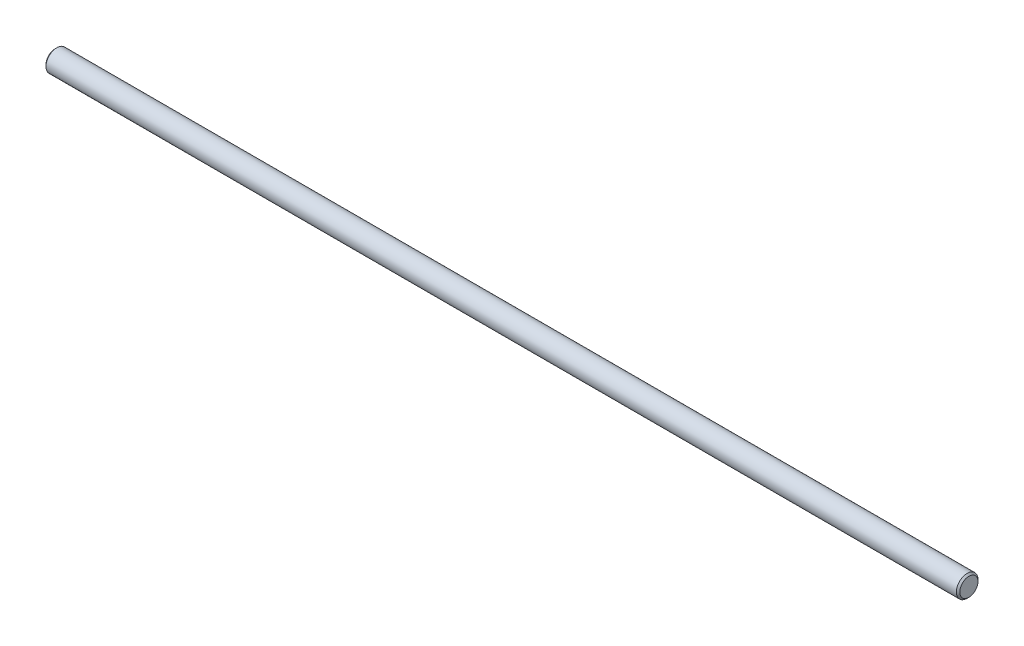
ISO-10303-21;
HEADER;
FILE_DESCRIPTION(('STEP AP214'),'2;1');
FILE_NAME('part.step','',(''),(''),'','','');
FILE_SCHEMA(('AUTOMOTIVE_DESIGN { 1 0 10303 214 1 1 1 1 }'));
ENDSEC;
DATA;
#1=APPLICATION_CONTEXT('core data for automotive mechanical design processes');
#2=APPLICATION_PROTOCOL_DEFINITION('international standard','automotive_design',2000,#1);
#3=PRODUCT_CONTEXT('',#1,'mechanical');
#4=PRODUCT('Part','Part','',(#3));
#5=PRODUCT_RELATED_PRODUCT_CATEGORY('part','',(#4));
#6=PRODUCT_DEFINITION_FORMATION('','',#4);
#7=PRODUCT_DEFINITION_CONTEXT('part definition',#1,'design');
#8=PRODUCT_DEFINITION('design','',#6,#7);
#9=PRODUCT_DEFINITION_SHAPE('','',#8);
#10=(LENGTH_UNIT() NAMED_UNIT(*) SI_UNIT(.MILLI.,.METRE.));
#11=(NAMED_UNIT(*) PLANE_ANGLE_UNIT() SI_UNIT($,.RADIAN.));
#12=(NAMED_UNIT(*) SI_UNIT($,.STERADIAN.) SOLID_ANGLE_UNIT());
#13=UNCERTAINTY_MEASURE_WITH_UNIT(LENGTH_MEASURE(1.E-05),#10,'distance_accuracy_value','');
#14=(GEOMETRIC_REPRESENTATION_CONTEXT(3) GLOBAL_UNCERTAINTY_ASSIGNED_CONTEXT((#13)) GLOBAL_UNIT_ASSIGNED_CONTEXT((#10,
#11,#12)) REPRESENTATION_CONTEXT('',''));
#15=CARTESIAN_POINT('',(0.,0.,0.));
#16=DIRECTION('',(0.,0.,1.));
#17=DIRECTION('',(1.,0.,0.));
#18=AXIS2_PLACEMENT_3D('',#15,#16,#17);
#19=CARTESIAN_POINT('',(268.,0.,0.));
#20=DIRECTION('',(-1.,0.,0.));
#21=DIRECTION('',(0.,0.,1.));
#22=AXIS2_PLACEMENT_3D('',#19,#20,#21);
#23=CYLINDRICAL_SURFACE('',#22,6.35);
#24=CARTESIAN_POINT('',(267.,0.,0.));
#25=DIRECTION('',(1.,0.,0.));
#26=DIRECTION('',(0.,0.,-1.));
#27=AXIS2_PLACEMENT_3D('',#24,#25,#26);
#28=CIRCLE('',#27,6.35);
#29=CARTESIAN_POINT('',(267.,0.,-6.35));
#30=VERTEX_POINT('',#29);
#31=EDGE_CURVE('E10',#30,#30,#28,.F.);
#32=ORIENTED_EDGE('',*,*,#31,.T.);
#33=EDGE_LOOP('',(#32));
#34=FACE_BOUND('',#33,.T.);
#35=CARTESIAN_POINT('',(-267.,0.,0.));
#36=DIRECTION('',(1.,0.,0.));
#37=DIRECTION('',(0.,0.,-1.));
#38=AXIS2_PLACEMENT_3D('',#35,#36,#37);
#39=CIRCLE('',#38,6.35);
#40=CARTESIAN_POINT('',(-267.,0.,-6.35));
#41=VERTEX_POINT('',#40);
#42=EDGE_CURVE('E57',#41,#41,#39,.T.);
#43=ORIENTED_EDGE('',*,*,#42,.T.);
#44=EDGE_LOOP('',(#43));
#45=FACE_BOUND('',#44,.T.);
#46=ADVANCED_FACE('F41',(#34,#45),#23,.T.);
#47=CARTESIAN_POINT('',(268.,0.,0.));
#48=DIRECTION('',(1.,0.,0.));
#49=DIRECTION('',(0.,0.,-1.));
#50=AXIS2_PLACEMENT_3D('',#47,#48,#49);
#51=PLANE('',#50);
#52=CARTESIAN_POINT('',(268.,0.,0.));
#53=DIRECTION('',(1.,0.,0.));
#54=DIRECTION('',(0.,0.,-1.));
#55=AXIS2_PLACEMENT_3D('',#52,#53,#54);
#56=CIRCLE('',#55,5.34999999999991);
#57=CARTESIAN_POINT('',(268.,0.,-5.34999999999991));
#58=VERTEX_POINT('',#57);
#59=EDGE_CURVE('E49',#58,#58,#56,.T.);
#60=ORIENTED_EDGE('',*,*,#59,.T.);
#61=EDGE_LOOP('',(#60));
#62=FACE_BOUND('',#61,.T.);
#63=ADVANCED_FACE('F73',(#62),#51,.T.);
#64=CARTESIAN_POINT('',(-268.,0.,0.));
#65=DIRECTION('',(1.,0.,0.));
#66=DIRECTION('',(0.,0.,-1.));
#67=AXIS2_PLACEMENT_3D('',#64,#65,#66);
#68=PLANE('',#67);
#69=CARTESIAN_POINT('',(-268.,0.,0.));
#70=DIRECTION('',(1.,0.,0.));
#71=DIRECTION('',(0.,0.,-1.));
#72=AXIS2_PLACEMENT_3D('',#69,#70,#71);
#73=CIRCLE('',#72,5.34999999999997);
#74=CARTESIAN_POINT('',(-268.,0.,-5.34999999999997));
#75=VERTEX_POINT('',#74);
#76=EDGE_CURVE('E53',#75,#75,#73,.F.);
#77=ORIENTED_EDGE('',*,*,#76,.T.);
#78=EDGE_LOOP('',(#77));
#79=FACE_BOUND('',#78,.T.);
#80=ADVANCED_FACE('F66',(#79),#68,.F.);
#81=CARTESIAN_POINT('',(-267.,0.,0.));
#82=DIRECTION('',(1.,0.,0.));
#83=DIRECTION('',(0.,0.,-1.));
#84=AXIS2_PLACEMENT_3D('',#81,#82,#83);
#85=CONICAL_SURFACE('',#84,6.35,0.785398163397465);
#86=ORIENTED_EDGE('',*,*,#76,.F.);
#87=EDGE_LOOP('',(#86));
#88=FACE_BOUND('',#87,.T.);
#89=ORIENTED_EDGE('',*,*,#42,.F.);
#90=EDGE_LOOP('',(#89));
#91=FACE_BOUND('',#90,.T.);
#92=ADVANCED_FACE('F64',(#88,#91),#85,.T.);
#93=CARTESIAN_POINT('',(268.,0.,0.));
#94=DIRECTION('',(-1.,0.,0.));
#95=DIRECTION('',(0.,0.,1.));
#96=AXIS2_PLACEMENT_3D('',#93,#94,#95);
#97=CONICAL_SURFACE('',#96,5.34999999999991,0.785398163397465);
#98=ORIENTED_EDGE('',*,*,#31,.F.);
#99=EDGE_LOOP('',(#98));
#100=FACE_BOUND('',#99,.T.);
#101=ORIENTED_EDGE('',*,*,#59,.F.);
#102=EDGE_LOOP('',(#101));
#103=FACE_BOUND('',#102,.T.);
#104=ADVANCED_FACE('F44',(#100,#103),#97,.T.);
#105=CLOSED_SHELL('',(#46,#63,#80,#92,#104));
#106=MANIFOLD_SOLID_BREP('B2',#105);
#107=ADVANCED_BREP_SHAPE_REPRESENTATION('',(#18,#106),#14);
#108=SHAPE_DEFINITION_REPRESENTATION(#9,#107);
ENDSEC;
END-ISO-10303-21;
